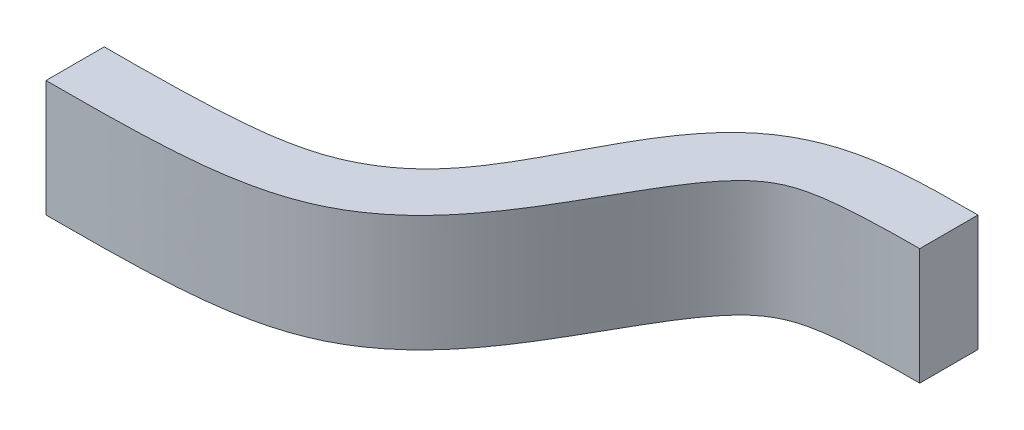
ISO-10303-21;
HEADER;
FILE_DESCRIPTION(('STEP AP214'),'2;1');
FILE_NAME('part.step','',(''),(''),'','','');
FILE_SCHEMA(('AUTOMOTIVE_DESIGN { 1 0 10303 214 1 1 1 1 }'));
ENDSEC;
DATA;
#1=APPLICATION_CONTEXT('core data for automotive mechanical design processes');
#2=APPLICATION_PROTOCOL_DEFINITION('international standard','automotive_design',2000,#1);
#3=PRODUCT_CONTEXT('',#1,'mechanical');
#4=PRODUCT('Part','Part','',(#3));
#5=PRODUCT_RELATED_PRODUCT_CATEGORY('part','',(#4));
#6=PRODUCT_DEFINITION_FORMATION('','',#4);
#7=PRODUCT_DEFINITION_CONTEXT('part definition',#1,'design');
#8=PRODUCT_DEFINITION('design','',#6,#7);
#9=PRODUCT_DEFINITION_SHAPE('','',#8);
#10=(LENGTH_UNIT() NAMED_UNIT(*) SI_UNIT(.MILLI.,.METRE.));
#11=(NAMED_UNIT(*) PLANE_ANGLE_UNIT() SI_UNIT($,.RADIAN.));
#12=(NAMED_UNIT(*) SI_UNIT($,.STERADIAN.) SOLID_ANGLE_UNIT());
#13=UNCERTAINTY_MEASURE_WITH_UNIT(LENGTH_MEASURE(1.E-05),#10,'distance_accuracy_value','');
#14=(GEOMETRIC_REPRESENTATION_CONTEXT(3) GLOBAL_UNCERTAINTY_ASSIGNED_CONTEXT((#13)) GLOBAL_UNIT_ASSIGNED_CONTEXT((#10,
#11,#12)) REPRESENTATION_CONTEXT('',''));
#15=CARTESIAN_POINT('',(0.,0.,0.));
#16=DIRECTION('',(0.,0.,1.));
#17=DIRECTION('',(1.,0.,0.));
#18=AXIS2_PLACEMENT_3D('',#15,#16,#17);
#19=CARTESIAN_POINT('',(0.,0.1,0.05));
#20=CARTESIAN_POINT('',(0.0855390686819897,0.1,0.05));
#21=CARTESIAN_POINT('',(0.27530876630969,0.1,0.049254339402187));
#22=CARTESIAN_POINT('',(0.504233783998882,0.1,-0.0129122051909076));
#23=CARTESIAN_POINT('',(0.644809226484156,0.1,-0.238145376827408));
#24=CARTESIAN_POINT('',(0.73007979193581,0.1,-0.405093617767417));
#25=CARTESIAN_POINT('',(0.826687482667918,0.1,-0.447245060791944));
#26=CARTESIAN_POINT('',(0.94827860922947,0.1,-0.45));
#27=CARTESIAN_POINT('',(1.,0.1,-0.45));
#28=B_SPLINE_CURVE_WITH_KNOTS('',3,(#19,#20,#21,#22,#23,#24,#25,#26,#27),.UNSPECIFIED.,.F.,.F.,
(4,1,1,1,1,1,4),(0.,0.125,0.25,0.5,0.75,0.875,1.),.UNSPECIFIED.);
#29=DIRECTION('',(0.,-1.,0.));
#30=VECTOR('',#29,1.);
#31=SURFACE_OF_LINEAR_EXTRUSION('',#28,#30);
#32=CARTESIAN_POINT('',(0.,-0.1,0.05));
#33=CARTESIAN_POINT('',(0.0855390686819897,-0.1,0.05));
#34=CARTESIAN_POINT('',(0.27530876630969,-0.1,0.049254339402187));
#35=CARTESIAN_POINT('',(0.504233783998882,-0.1,-0.0129122051909076));
#36=CARTESIAN_POINT('',(0.644809226484156,-0.1,-0.238145376827408));
#37=CARTESIAN_POINT('',(0.73007979193581,-0.1,-0.405093617767417));
#38=CARTESIAN_POINT('',(0.826687482667918,-0.1,-0.447245060791944));
#39=CARTESIAN_POINT('',(0.94827860922947,-0.1,-0.45));
#40=CARTESIAN_POINT('',(1.,-0.1,-0.45));
#41=B_SPLINE_CURVE_WITH_KNOTS('',3,(#32,#33,#34,#35,#36,#37,#38,#39,#40),.UNSPECIFIED.,.F.,.F.,
(4,1,1,1,1,1,4),(0.,0.125,0.25,0.5,0.75,0.875,1.),.UNSPECIFIED.);
#42=CARTESIAN_POINT('',(0.,-0.1,0.05));
#43=VERTEX_POINT('',#42);
#44=CARTESIAN_POINT('',(1.,-0.1,-0.45));
#45=VERTEX_POINT('',#44);
#46=EDGE_CURVE('E119',#43,#45,#41,.T.);
#47=ORIENTED_EDGE('',*,*,#46,.T.);
#48=DIRECTION('',(0.,-1.,0.));
#49=VECTOR('',#48,1.);
#50=CARTESIAN_POINT('',(1.,0.1,-0.45));
#51=LINE('',#50,#49);
#52=CARTESIAN_POINT('',(1.,0.1,-0.45));
#53=VERTEX_POINT('',#52);
#54=EDGE_CURVE('E11',#53,#45,#51,.T.);
#55=ORIENTED_EDGE('',*,*,#54,.F.);
#56=CARTESIAN_POINT('',(0.,0.1,0.05));
#57=VERTEX_POINT('',#56);
#58=EDGE_CURVE('E88',#57,#53,#28,.T.);
#59=ORIENTED_EDGE('',*,*,#58,.F.);
#60=DIRECTION('',(0.,-1.,0.));
#61=VECTOR('',#60,1.);
#62=CARTESIAN_POINT('',(0.,0.1,0.05));
#63=LINE('',#62,#61);
#64=EDGE_CURVE('E96',#57,#43,#63,.T.);
#65=ORIENTED_EDGE('',*,*,#64,.T.);
#66=EDGE_LOOP('',(#47,#55,#59,#65));
#67=FACE_BOUND('',#66,.T.);
#68=ADVANCED_FACE('F36',(#67),#31,.F.);
#69=CARTESIAN_POINT('',(1.,0.1,-0.45));
#70=DIRECTION('',(-1.,0.,0.));
#71=DIRECTION('',(0.,0.,1.));
#72=AXIS2_PLACEMENT_3D('',#69,#70,#71);
#73=PLANE('',#72);
#74=DIRECTION('',(0.,0.,-1.));
#75=VECTOR('',#74,1.);
#76=CARTESIAN_POINT('',(1.,-0.1,-0.45));
#77=LINE('',#76,#75);
#78=CARTESIAN_POINT('',(1.,-0.1,-0.55));
#79=VERTEX_POINT('',#78);
#80=EDGE_CURVE('E92',#45,#79,#77,.T.);
#81=ORIENTED_EDGE('',*,*,#80,.T.);
#82=DIRECTION('',(0.,-1.,0.));
#83=VECTOR('',#82,1.);
#84=CARTESIAN_POINT('',(1.,0.1,-0.55));
#85=LINE('',#84,#83);
#86=CARTESIAN_POINT('',(1.,0.1,-0.55));
#87=VERTEX_POINT('',#86);
#88=EDGE_CURVE('E45',#87,#79,#85,.T.);
#89=ORIENTED_EDGE('',*,*,#88,.F.);
#90=DIRECTION('',(0.,0.,-1.));
#91=VECTOR('',#90,1.);
#92=CARTESIAN_POINT('',(1.,0.1,-0.45));
#93=LINE('',#92,#91);
#94=EDGE_CURVE('E83',#53,#87,#93,.T.);
#95=ORIENTED_EDGE('',*,*,#94,.F.);
#96=ORIENTED_EDGE('',*,*,#54,.T.);
#97=EDGE_LOOP('',(#81,#89,#95,#96));
#98=FACE_BOUND('',#97,.T.);
#99=ADVANCED_FACE('F91',(#98),#73,.F.);
#100=CARTESIAN_POINT('',(1.,0.1,-0.55));
#101=CARTESIAN_POINT('',(0.942740126421645,0.1,-0.55));
#102=CARTESIAN_POINT('',(0.819170576988637,0.1,-0.55024059951283));
#103=CARTESIAN_POINT('',(0.646200467543306,0.1,-0.47906011195871));
#104=CARTESIAN_POINT('',(0.566439658554294,0.1,-0.307258725682603));
#105=CARTESIAN_POINT('',(0.483662411349688,0.1,-0.163067030001439));
#106=CARTESIAN_POINT('',(0.399012392889436,0.1,-0.0908033451860727));
#107=CARTESIAN_POINT('',(0.27172173560272,0.1,-0.0515799286404136));
#108=CARTESIAN_POINT('',(0.0818646709430316,0.1,-0.05));
#109=CARTESIAN_POINT('',(0.,0.1,-0.05));
#110=B_SPLINE_CURVE_WITH_KNOTS('',3,(#100,#101,#102,#103,#104,#105,#106,#107,#108,#109),
.UNSPECIFIED.,.F.,.F.,(4,1,1,1,1,1,1,4),(0.,0.125,0.25,0.5,0.625,0.75,0.875,1.),.UNSPECIFIED.);
#111=DIRECTION('',(0.,-1.,0.));
#112=VECTOR('',#111,1.);
#113=SURFACE_OF_LINEAR_EXTRUSION('',#110,#112);
#114=CARTESIAN_POINT('',(1.,-0.1,-0.55));
#115=CARTESIAN_POINT('',(0.942740126421645,-0.1,-0.55));
#116=CARTESIAN_POINT('',(0.819170576988637,-0.1,-0.55024059951283));
#117=CARTESIAN_POINT('',(0.646200467543306,-0.1,-0.47906011195871));
#118=CARTESIAN_POINT('',(0.566439658554294,-0.1,-0.307258725682603));
#119=CARTESIAN_POINT('',(0.483662411349688,-0.1,-0.163067030001439));
#120=CARTESIAN_POINT('',(0.399012392889436,-0.1,-0.0908033451860727));
#121=CARTESIAN_POINT('',(0.27172173560272,-0.1,-0.0515799286404136));
#122=CARTESIAN_POINT('',(0.0818646709430316,-0.1,-0.05));
#123=CARTESIAN_POINT('',(0.,-0.1,-0.05));
#124=B_SPLINE_CURVE_WITH_KNOTS('',3,(#114,#115,#116,#117,#118,#119,#120,#121,#122,#123),
.UNSPECIFIED.,.F.,.F.,(4,1,1,1,1,1,1,4),(0.,0.125,0.25,0.5,0.625,0.75,0.875,1.),.UNSPECIFIED.);
#125=CARTESIAN_POINT('',(0.,-0.1,-0.05));
#126=VERTEX_POINT('',#125);
#127=EDGE_CURVE('E70',#79,#126,#124,.T.);
#128=ORIENTED_EDGE('',*,*,#127,.T.);
#129=DIRECTION('',(0.,-1.,0.));
#130=VECTOR('',#129,1.);
#131=CARTESIAN_POINT('',(0.,0.1,-0.05));
#132=LINE('',#131,#130);
#133=CARTESIAN_POINT('',(0.,0.1,-0.05));
#134=VERTEX_POINT('',#133);
#135=EDGE_CURVE('E93',#134,#126,#132,.T.);
#136=ORIENTED_EDGE('',*,*,#135,.F.);
#137=EDGE_CURVE('E86',#87,#134,#110,.T.);
#138=ORIENTED_EDGE('',*,*,#137,.F.);
#139=ORIENTED_EDGE('',*,*,#88,.T.);
#140=EDGE_LOOP('',(#128,#136,#138,#139));
#141=FACE_BOUND('',#140,.T.);
#142=ADVANCED_FACE('F94',(#141),#113,.F.);
#143=CARTESIAN_POINT('',(0.,0.1,0.05));
#144=DIRECTION('',(1.,0.,0.));
#145=DIRECTION('',(0.,0.,-1.));
#146=AXIS2_PLACEMENT_3D('',#143,#144,#145);
#147=PLANE('',#146);
#148=DIRECTION('',(0.,0.,1.));
#149=VECTOR('',#148,1.);
#150=CARTESIAN_POINT('',(0.,-0.1,0.05));
#151=LINE('',#150,#149);
#152=EDGE_CURVE('E76',#126,#43,#151,.T.);
#153=ORIENTED_EDGE('',*,*,#152,.T.);
#154=ORIENTED_EDGE('',*,*,#64,.F.);
#155=DIRECTION('',(0.,0.,1.));
#156=VECTOR('',#155,1.);
#157=CARTESIAN_POINT('',(0.,0.1,0.05));
#158=LINE('',#157,#156);
#159=EDGE_CURVE('E53',#134,#57,#158,.T.);
#160=ORIENTED_EDGE('',*,*,#159,.F.);
#161=ORIENTED_EDGE('',*,*,#135,.T.);
#162=EDGE_LOOP('',(#153,#154,#160,#161));
#163=FACE_BOUND('',#162,.T.);
#164=ADVANCED_FACE('F108',(#163),#147,.F.);
#165=CARTESIAN_POINT('',(0.633748251077432,0.1,-0.226488390688109));
#166=DIRECTION('',(0.,-1.,0.));
#167=DIRECTION('',(0.,0.,-1.));
#168=AXIS2_PLACEMENT_3D('',#165,#166,#167);
#169=PLANE('',#168);
#170=ORIENTED_EDGE('',*,*,#58,.T.);
#171=ORIENTED_EDGE('',*,*,#94,.T.);
#172=ORIENTED_EDGE('',*,*,#137,.T.);
#173=ORIENTED_EDGE('',*,*,#159,.T.);
#174=EDGE_LOOP('',(#170,#171,#172,#173));
#175=FACE_BOUND('',#174,.T.);
#176=ADVANCED_FACE('F84',(#175),#169,.F.);
#177=CARTESIAN_POINT('',(0.633748251077432,-0.1,-0.226488390688109));
#178=DIRECTION('',(0.,-1.,0.));
#179=DIRECTION('',(0.,0.,-1.));
#180=AXIS2_PLACEMENT_3D('',#177,#178,#179);
#181=PLANE('',#180);
#182=ORIENTED_EDGE('',*,*,#46,.F.);
#183=ORIENTED_EDGE('',*,*,#152,.F.);
#184=ORIENTED_EDGE('',*,*,#127,.F.);
#185=ORIENTED_EDGE('',*,*,#80,.F.);
#186=EDGE_LOOP('',(#182,#183,#184,#185));
#187=FACE_BOUND('',#186,.T.);
#188=ADVANCED_FACE('F136',(#187),#181,.T.);
#189=CLOSED_SHELL('',(#68,#99,#142,#164,#176,#188));
#190=MANIFOLD_SOLID_BREP('B2',#189);
#191=ADVANCED_BREP_SHAPE_REPRESENTATION('',(#18,#190),#14);
#192=SHAPE_DEFINITION_REPRESENTATION(#9,#191);
ENDSEC;
END-ISO-10303-21;
